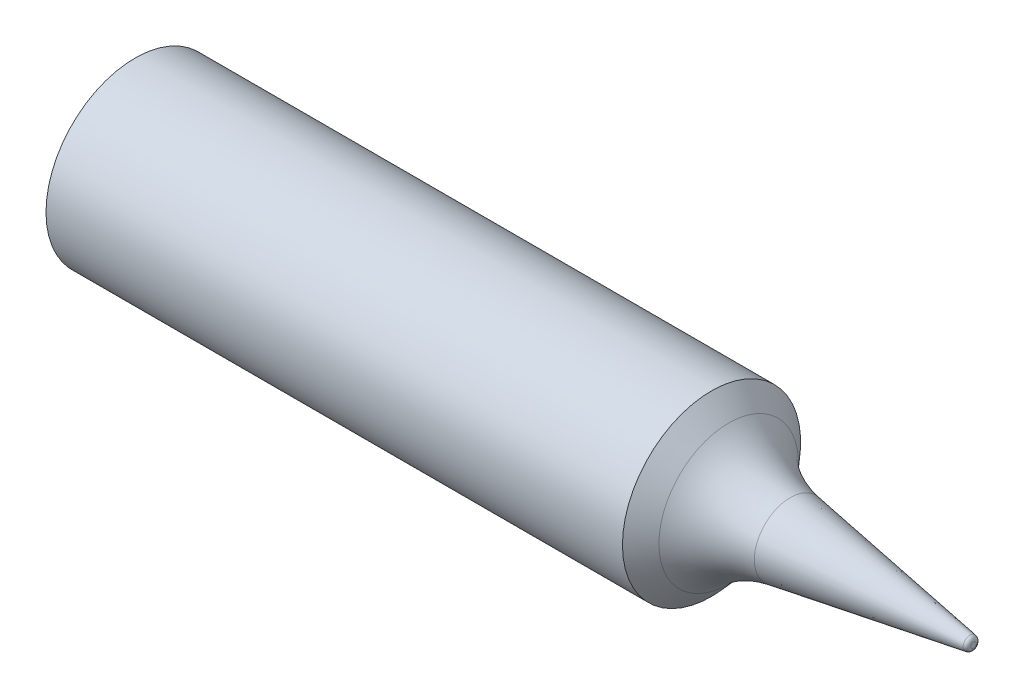
ISO-10303-21;
HEADER;
FILE_DESCRIPTION(('STEP AP214'),'2;1');
FILE_NAME('part.step','',(''),(''),'','','');
FILE_SCHEMA(('AUTOMOTIVE_DESIGN { 1 0 10303 214 1 1 1 1 }'));
ENDSEC;
DATA;
#1=APPLICATION_CONTEXT('core data for automotive mechanical design processes');
#2=APPLICATION_PROTOCOL_DEFINITION('international standard','automotive_design',2000,#1);
#3=PRODUCT_CONTEXT('',#1,'mechanical');
#4=PRODUCT('Part','Part','',(#3));
#5=PRODUCT_RELATED_PRODUCT_CATEGORY('part','',(#4));
#6=PRODUCT_DEFINITION_FORMATION('','',#4);
#7=PRODUCT_DEFINITION_CONTEXT('part definition',#1,'design');
#8=PRODUCT_DEFINITION('design','',#6,#7);
#9=PRODUCT_DEFINITION_SHAPE('','',#8);
#10=(LENGTH_UNIT() NAMED_UNIT(*) SI_UNIT(.MILLI.,.METRE.));
#11=(NAMED_UNIT(*) PLANE_ANGLE_UNIT() SI_UNIT($,.RADIAN.));
#12=(NAMED_UNIT(*) SI_UNIT($,.STERADIAN.) SOLID_ANGLE_UNIT());
#13=UNCERTAINTY_MEASURE_WITH_UNIT(LENGTH_MEASURE(1.E-05),#10,'distance_accuracy_value','');
#14=(GEOMETRIC_REPRESENTATION_CONTEXT(3) GLOBAL_UNCERTAINTY_ASSIGNED_CONTEXT((#13)) GLOBAL_UNIT_ASSIGNED_CONTEXT((#10,
#11,#12)) REPRESENTATION_CONTEXT('',''));
#15=CARTESIAN_POINT('',(0.,0.,0.));
#16=DIRECTION('',(0.,0.,1.));
#17=DIRECTION('',(1.,0.,0.));
#18=AXIS2_PLACEMENT_3D('',#15,#16,#17);
#19=CARTESIAN_POINT('',(27.0733872389053,0.,0.));
#20=DIRECTION('',(-1.,0.,0.));
#21=DIRECTION('',(0.,0.,1.));
#22=AXIS2_PLACEMENT_3D('',#19,#20,#21);
#23=CONICAL_SURFACE('',#22,3.3,0.844153986113172);
#24=CARTESIAN_POINT('',(30.0067205722386,0.,0.));
#25=VERTEX_POINT('',#24);
#26=VERTEX_LOOP('',#25);
#27=FACE_BOUND('',#26,.T.);
#28=CARTESIAN_POINT('',(27.0733872389053,0.,0.));
#29=DIRECTION('',(-1.,0.,0.));
#30=DIRECTION('',(0.,0.,1.));
#31=AXIS2_PLACEMENT_3D('',#28,#29,#30);
#32=CIRCLE('',#31,3.3);
#33=CARTESIAN_POINT('',(27.0733872389053,0.,3.3));
#34=VERTEX_POINT('',#33);
#35=EDGE_CURVE('E11',#34,#34,#32,.T.);
#36=ORIENTED_EDGE('',*,*,#35,.T.);
#37=EDGE_LOOP('',(#36));
#38=FACE_BOUND('',#37,.T.);
#39=ADVANCED_FACE('F41',(#27,#38),#23,.F.);
#40=CARTESIAN_POINT('',(0.,0.,0.));
#41=DIRECTION('',(-1.,0.,0.));
#42=DIRECTION('',(0.,0.,1.));
#43=AXIS2_PLACEMENT_3D('',#40,#41,#42);
#44=CYLINDRICAL_SURFACE('',#43,3.3);
#45=ORIENTED_EDGE('',*,*,#35,.F.);
#46=EDGE_LOOP('',(#45));
#47=FACE_BOUND('',#46,.T.);
#48=CARTESIAN_POINT('',(0.,0.,0.));
#49=DIRECTION('',(-1.,0.,0.));
#50=DIRECTION('',(0.,0.,1.));
#51=AXIS2_PLACEMENT_3D('',#48,#49,#50);
#52=CIRCLE('',#51,3.3);
#53=CARTESIAN_POINT('',(0.,0.,3.3));
#54=VERTEX_POINT('',#53);
#55=EDGE_CURVE('E47',#54,#54,#52,.T.);
#56=ORIENTED_EDGE('',*,*,#55,.T.);
#57=EDGE_LOOP('',(#56));
#58=FACE_BOUND('',#57,.T.);
#59=ADVANCED_FACE('F52',(#47,#58),#44,.F.);
#60=CARTESIAN_POINT('',(0.,3.3,0.));
#61=DIRECTION('',(1.,0.,0.));
#62=DIRECTION('',(0.,0.,-1.));
#63=AXIS2_PLACEMENT_3D('',#60,#61,#62);
#64=PLANE('',#63);
#65=ORIENTED_EDGE('',*,*,#55,.F.);
#66=EDGE_LOOP('',(#65));
#67=FACE_BOUND('',#66,.T.);
#68=CARTESIAN_POINT('',(0.,0.,0.));
#69=DIRECTION('',(-1.,0.,0.));
#70=DIRECTION('',(0.,0.,1.));
#71=AXIS2_PLACEMENT_3D('',#68,#69,#70);
#72=CIRCLE('',#71,4.25);
#73=CARTESIAN_POINT('',(0.,0.,4.25));
#74=VERTEX_POINT('',#73);
#75=EDGE_CURVE('E61',#74,#74,#72,.T.);
#76=ORIENTED_EDGE('',*,*,#75,.T.);
#77=EDGE_LOOP('',(#76));
#78=FACE_BOUND('',#77,.T.);
#79=ADVANCED_FACE('F57',(#67,#78),#64,.F.);
#80=CARTESIAN_POINT('',(0.,0.,0.));
#81=DIRECTION('',(-1.,0.,0.));
#82=DIRECTION('',(0.,0.,1.));
#83=AXIS2_PLACEMENT_3D('',#80,#81,#82);
#84=CYLINDRICAL_SURFACE('',#83,4.25);
#85=ORIENTED_EDGE('',*,*,#75,.F.);
#86=EDGE_LOOP('',(#85));
#87=FACE_BOUND('',#86,.T.);
#88=CARTESIAN_POINT('',(27.5,0.,0.));
#89=DIRECTION('',(-1.,0.,0.));
#90=DIRECTION('',(0.,0.,1.));
#91=AXIS2_PLACEMENT_3D('',#88,#89,#90);
#92=CIRCLE('',#91,4.25);
#93=CARTESIAN_POINT('',(27.5,0.,4.25));
#94=VERTEX_POINT('',#93);
#95=EDGE_CURVE('E63',#94,#94,#92,.T.);
#96=ORIENTED_EDGE('',*,*,#95,.T.);
#97=EDGE_LOOP('',(#96));
#98=FACE_BOUND('',#97,.T.);
#99=ADVANCED_FACE('F103',(#87,#98),#84,.T.);
#100=CARTESIAN_POINT('',(28.3181395940749,0.,0.));
#101=DIRECTION('',(-1.,0.,0.));
#102=DIRECTION('',(0.,0.,1.));
#103=AXIS2_PLACEMENT_3D('',#100,#101,#102);
#104=CONICAL_SURFACE('',#103,3.3295929566657,0.84415398611317);
#105=ORIENTED_EDGE('',*,*,#95,.F.);
#106=EDGE_LOOP('',(#105));
#107=FACE_BOUND('',#106,.T.);
#108=CARTESIAN_POINT('',(28.3181395940749,0.,0.));
#109=DIRECTION('',(-1.,0.,0.));
#110=DIRECTION('',(0.,0.,1.));
#111=AXIS2_PLACEMENT_3D('',#108,#109,#110);
#112=CIRCLE('',#111,3.3295929566657);
#113=CARTESIAN_POINT('',(28.3181395940749,0.,3.3295929566657));
#114=VERTEX_POINT('',#113);
#115=EDGE_CURVE('E68',#114,#114,#112,.T.);
#116=ORIENTED_EDGE('',*,*,#115,.T.);
#117=EDGE_LOOP('',(#116));
#118=FACE_BOUND('',#117,.T.);
#119=ADVANCED_FACE('F99',(#107,#118),#104,.T.);
#120=CARTESIAN_POINT('',(32.0551861874932,0.,0.));
#121=DIRECTION('',(-1.,0.,0.));
#122=DIRECTION('',(0.,0.,1.));
#123=AXIS2_PLACEMENT_3D('',#120,#121,#122);
#124=TOROIDAL_SURFACE('',#123,6.65141215081528,5.);
#125=ORIENTED_EDGE('',*,*,#115,.F.);
#126=EDGE_LOOP('',(#125));
#127=FACE_BOUND('',#126,.T.);
#128=CARTESIAN_POINT('',(31.2560683248991,0.,0.));
#129=DIRECTION('',(-1.,0.,0.));
#130=DIRECTION('',(0.,0.,1.));
#131=AXIS2_PLACEMENT_3D('',#128,#129,#130);
#132=CIRCLE('',#131,1.71568417596872);
#133=CARTESIAN_POINT('',(31.2560683248991,0.,1.71568417596872));
#134=VERTEX_POINT('',#133);
#135=EDGE_CURVE('E71',#134,#134,#132,.T.);
#136=ORIENTED_EDGE('',*,*,#135,.T.);
#137=EDGE_LOOP('',(#136));
#138=FACE_BOUND('',#137,.T.);
#139=ADVANCED_FACE('F95',(#127,#138),#124,.F.);
#140=CARTESIAN_POINT('',(39.8319647145038,0.,0.));
#141=DIRECTION('',(-1.,0.,0.));
#142=DIRECTION('',(0.,0.,1.));
#143=AXIS2_PLACEMENT_3D('',#140,#141,#142);
#144=CONICAL_SURFACE('',#143,0.327205712889866,0.160511925481859);
#145=ORIENTED_EDGE('',*,*,#135,.F.);
#146=EDGE_LOOP('',(#145));
#147=FACE_BOUND('',#146,.T.);
#148=CARTESIAN_POINT('',(39.8319647145038,0.,0.));
#149=DIRECTION('',(-1.,0.,0.));
#150=DIRECTION('',(0.,0.,1.));
#151=AXIS2_PLACEMENT_3D('',#148,#149,#150);
#152=CIRCLE('',#151,0.327205712889866);
#153=CARTESIAN_POINT('',(39.8319647145038,0.,0.327205712889866));
#154=VERTEX_POINT('',#153);
#155=EDGE_CURVE('E74',#154,#154,#152,.T.);
#156=ORIENTED_EDGE('',*,*,#155,.T.);
#157=EDGE_LOOP('',(#156));
#158=FACE_BOUND('',#157,.T.);
#159=ADVANCED_FACE('F89',(#147,#158),#144,.T.);
#160=CARTESIAN_POINT('',(39.8,0.,0.));
#161=DIRECTION('',(-1.,0.,0.));
#162=DIRECTION('',(0.,0.,1.));
#163=AXIS2_PLACEMENT_3D('',#160,#161,#162);
#164=DEGENERATE_TOROIDAL_SURFACE('',#163,0.129776593896004,0.199999999999999,.T.);
#165=ORIENTED_EDGE('',*,*,#155,.F.);
#166=EDGE_LOOP('',(#165));
#167=FACE_BOUND('',#166,.T.);
#168=CARTESIAN_POINT('',(40.,0.,0.));
#169=DIRECTION('',(-1.,0.,0.));
#170=DIRECTION('',(0.,0.,1.));
#171=AXIS2_PLACEMENT_3D('',#168,#169,#170);
#172=CIRCLE('',#171,0.129776593896003);
#173=CARTESIAN_POINT('',(40.,0.,0.129776593896003));
#174=VERTEX_POINT('',#173);
#175=EDGE_CURVE('E77',#174,#174,#172,.T.);
#176=ORIENTED_EDGE('',*,*,#175,.T.);
#177=EDGE_LOOP('',(#176));
#178=FACE_BOUND('',#177,.T.);
#179=ADVANCED_FACE('F81',(#167,#178),#164,.T.);
#180=CARTESIAN_POINT('',(40.,0.,0.));
#181=DIRECTION('',(-1.,0.,0.));
#182=DIRECTION('',(0.,0.,1.));
#183=AXIS2_PLACEMENT_3D('',#180,#181,#182);
#184=PLANE('',#183);
#185=ORIENTED_EDGE('',*,*,#175,.F.);
#186=EDGE_LOOP('',(#185));
#187=FACE_BOUND('',#186,.T.);
#188=ADVANCED_FACE('F83',(#187),#184,.F.);
#189=CLOSED_SHELL('',(#39,#59,#79,#99,#119,#139,#159,#179,#188));
#190=MANIFOLD_SOLID_BREP('B2',#189);
#191=ADVANCED_BREP_SHAPE_REPRESENTATION('',(#18,#190),#14);
#192=SHAPE_DEFINITION_REPRESENTATION(#9,#191);
ENDSEC;
END-ISO-10303-21;
